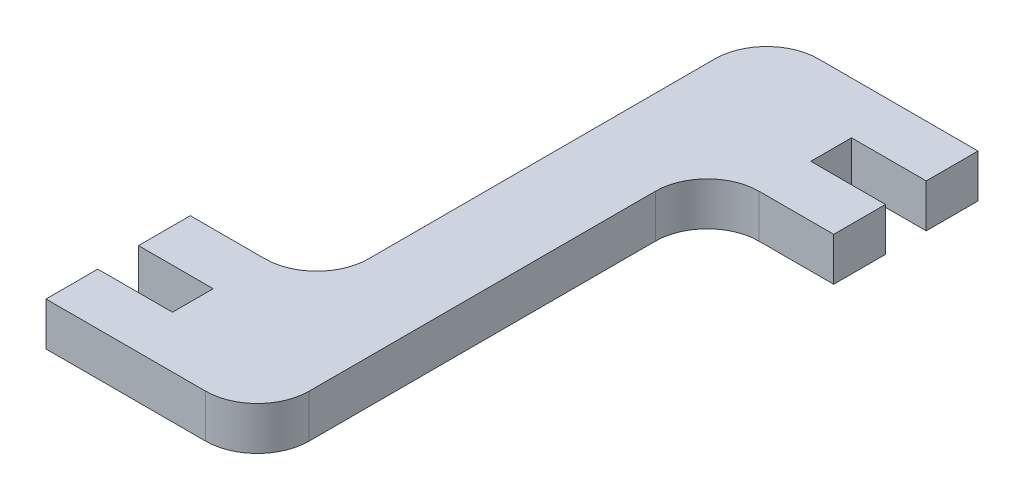
ISO-10303-21;
HEADER;
FILE_DESCRIPTION(('STEP AP214'),'2;1');
FILE_NAME('part.step','',(''),(''),'','','');
FILE_SCHEMA(('AUTOMOTIVE_DESIGN { 1 0 10303 214 1 1 1 1 }'));
ENDSEC;
DATA;
#1=APPLICATION_CONTEXT('core data for automotive mechanical design processes');
#2=APPLICATION_PROTOCOL_DEFINITION('international standard','automotive_design',2000,#1);
#3=PRODUCT_CONTEXT('',#1,'mechanical');
#4=PRODUCT('Part','Part','',(#3));
#5=PRODUCT_RELATED_PRODUCT_CATEGORY('part','',(#4));
#6=PRODUCT_DEFINITION_FORMATION('','',#4);
#7=PRODUCT_DEFINITION_CONTEXT('part definition',#1,'design');
#8=PRODUCT_DEFINITION('design','',#6,#7);
#9=PRODUCT_DEFINITION_SHAPE('','',#8);
#10=(LENGTH_UNIT() NAMED_UNIT(*) SI_UNIT(.MILLI.,.METRE.));
#11=(NAMED_UNIT(*) PLANE_ANGLE_UNIT() SI_UNIT($,.RADIAN.));
#12=(NAMED_UNIT(*) SI_UNIT($,.STERADIAN.) SOLID_ANGLE_UNIT());
#13=UNCERTAINTY_MEASURE_WITH_UNIT(LENGTH_MEASURE(1.E-05),#10,'distance_accuracy_value','');
#14=(GEOMETRIC_REPRESENTATION_CONTEXT(3) GLOBAL_UNCERTAINTY_ASSIGNED_CONTEXT((#13)) GLOBAL_UNIT_ASSIGNED_CONTEXT((#10,
#11,#12)) REPRESENTATION_CONTEXT('',''));
#15=CARTESIAN_POINT('',(0.,0.,0.));
#16=DIRECTION('',(0.,0.,1.));
#17=DIRECTION('',(1.,0.,0.));
#18=AXIS2_PLACEMENT_3D('',#15,#16,#17);
#19=CARTESIAN_POINT('',(0.,5.1,0.));
#20=DIRECTION('',(1.,0.,0.));
#21=DIRECTION('',(0.,0.,-1.));
#22=AXIS2_PLACEMENT_3D('',#19,#20,#21);
#23=PLANE('',#22);
#24=DIRECTION('',(0.,0.,1.));
#25=VECTOR('',#24,1.);
#26=CARTESIAN_POINT('',(0.,0.,0.));
#27=LINE('',#26,#25);
#28=CARTESIAN_POINT('',(0.,0.,-6.1));
#29=VERTEX_POINT('',#28);
#30=CARTESIAN_POINT('',(0.,0.,0.));
#31=VERTEX_POINT('',#30);
#32=EDGE_CURVE('E201',#29,#31,#27,.T.);
#33=ORIENTED_EDGE('',*,*,#32,.T.);
#34=DIRECTION('',(0.,-1.,0.));
#35=VECTOR('',#34,1.);
#36=CARTESIAN_POINT('',(0.,5.1,0.));
#37=LINE('',#36,#35);
#38=CARTESIAN_POINT('',(0.,5.1,0.));
#39=VERTEX_POINT('',#38);
#40=EDGE_CURVE('E11',#39,#31,#37,.T.);
#41=ORIENTED_EDGE('',*,*,#40,.F.);
#42=DIRECTION('',(0.,0.,1.));
#43=VECTOR('',#42,1.);
#44=CARTESIAN_POINT('',(0.,5.1,0.));
#45=LINE('',#44,#43);
#46=CARTESIAN_POINT('',(0.,5.1,-6.1));
#47=VERTEX_POINT('',#46);
#48=EDGE_CURVE('E239',#47,#39,#45,.T.);
#49=ORIENTED_EDGE('',*,*,#48,.F.);
#50=DIRECTION('',(0.,-1.,0.));
#51=VECTOR('',#50,1.);
#52=CARTESIAN_POINT('',(0.,5.1,-6.1));
#53=LINE('',#52,#51);
#54=EDGE_CURVE('E197',#47,#29,#53,.T.);
#55=ORIENTED_EDGE('',*,*,#54,.T.);
#56=EDGE_LOOP('',(#33,#41,#49,#55));
#57=FACE_BOUND('',#56,.T.);
#58=ADVANCED_FACE('F33',(#57),#23,.F.);
#59=CARTESIAN_POINT('',(0.,5.1,0.));
#60=DIRECTION('',(0.,0.,-1.));
#61=DIRECTION('',(-1.,0.,0.));
#62=AXIS2_PLACEMENT_3D('',#59,#60,#61);
#63=PLANE('',#62);
#64=DIRECTION('',(1.,0.,0.));
#65=VECTOR('',#64,1.);
#66=CARTESIAN_POINT('',(0.,0.,0.));
#67=LINE('',#66,#65);
#68=CARTESIAN_POINT('',(18.8,0.,0.));
#69=VERTEX_POINT('',#68);
#70=EDGE_CURVE('E204',#31,#69,#67,.T.);
#71=ORIENTED_EDGE('',*,*,#70,.T.);
#72=DIRECTION('',(0.,-1.,0.));
#73=VECTOR('',#72,1.);
#74=CARTESIAN_POINT('',(18.8,5.1,0.));
#75=LINE('',#74,#73);
#76=CARTESIAN_POINT('',(18.8,5.1,0.));
#77=VERTEX_POINT('',#76);
#78=EDGE_CURVE('E41',#77,#69,#75,.T.);
#79=ORIENTED_EDGE('',*,*,#78,.F.);
#80=DIRECTION('',(1.,0.,0.));
#81=VECTOR('',#80,1.);
#82=CARTESIAN_POINT('',(0.,5.1,0.));
#83=LINE('',#82,#81);
#84=EDGE_CURVE('E128',#39,#77,#83,.T.);
#85=ORIENTED_EDGE('',*,*,#84,.F.);
#86=ORIENTED_EDGE('',*,*,#40,.T.);
#87=EDGE_LOOP('',(#71,#79,#85,#86));
#88=FACE_BOUND('',#87,.T.);
#89=ADVANCED_FACE('F357',(#88),#63,.F.);
#90=CARTESIAN_POINT('',(18.8,5.1,-6.1));
#91=DIRECTION('',(0.,-1.,0.));
#92=DIRECTION('',(0.,0.,-1.));
#93=AXIS2_PLACEMENT_3D('',#90,#91,#92);
#94=CYLINDRICAL_SURFACE('',#93,6.1);
#95=CARTESIAN_POINT('',(18.8,0.,-6.1));
#96=DIRECTION('',(0.,1.,0.));
#97=DIRECTION('',(0.,0.,1.));
#98=AXIS2_PLACEMENT_3D('',#95,#96,#97);
#99=CIRCLE('',#98,6.1);
#100=CARTESIAN_POINT('',(24.9,0.,-6.1));
#101=VERTEX_POINT('',#100);
#102=EDGE_CURVE('E206',#69,#101,#99,.T.);
#103=ORIENTED_EDGE('',*,*,#102,.T.);
#104=DIRECTION('',(0.,-1.,0.));
#105=VECTOR('',#104,1.);
#106=CARTESIAN_POINT('',(24.9,5.1,-6.1));
#107=LINE('',#106,#105);
#108=CARTESIAN_POINT('',(24.9,5.1,-6.1));
#109=VERTEX_POINT('',#108);
#110=EDGE_CURVE('E282',#109,#101,#107,.T.);
#111=ORIENTED_EDGE('',*,*,#110,.F.);
#112=CARTESIAN_POINT('',(18.8,5.1,-6.1));
#113=DIRECTION('',(0.,1.,0.));
#114=DIRECTION('',(0.,0.,1.));
#115=AXIS2_PLACEMENT_3D('',#112,#113,#114);
#116=CIRCLE('',#115,6.1);
#117=EDGE_CURVE('E290',#77,#109,#116,.T.);
#118=ORIENTED_EDGE('',*,*,#117,.F.);
#119=ORIENTED_EDGE('',*,*,#78,.T.);
#120=EDGE_LOOP('',(#103,#111,#118,#119));
#121=FACE_BOUND('',#120,.T.);
#122=ADVANCED_FACE('F288',(#121),#94,.T.);
#123=CARTESIAN_POINT('',(24.9,5.1,-6.1));
#124=DIRECTION('',(-1.,0.,0.));
#125=DIRECTION('',(0.,0.,1.));
#126=AXIS2_PLACEMENT_3D('',#123,#124,#125);
#127=PLANE('',#126);
#128=DIRECTION('',(0.,0.,-1.));
#129=VECTOR('',#128,1.);
#130=CARTESIAN_POINT('',(24.9,0.,-6.1));
#131=LINE('',#130,#129);
#132=CARTESIAN_POINT('',(24.9,0.,-46.9));
#133=VERTEX_POINT('',#132);
#134=EDGE_CURVE('E208',#101,#133,#131,.T.);
#135=ORIENTED_EDGE('',*,*,#134,.T.);
#136=DIRECTION('',(0.,-1.,0.));
#137=VECTOR('',#136,1.);
#138=CARTESIAN_POINT('',(24.9,5.1,-46.9));
#139=LINE('',#138,#137);
#140=CARTESIAN_POINT('',(24.9,5.1,-46.9));
#141=VERTEX_POINT('',#140);
#142=EDGE_CURVE('E279',#141,#133,#139,.T.);
#143=ORIENTED_EDGE('',*,*,#142,.F.);
#144=DIRECTION('',(0.,0.,-1.));
#145=VECTOR('',#144,1.);
#146=CARTESIAN_POINT('',(24.9,5.1,-6.1));
#147=LINE('',#146,#145);
#148=EDGE_CURVE('E308',#109,#141,#147,.T.);
#149=ORIENTED_EDGE('',*,*,#148,.F.);
#150=ORIENTED_EDGE('',*,*,#110,.T.);
#151=EDGE_LOOP('',(#135,#143,#149,#150));
#152=FACE_BOUND('',#151,.T.);
#153=ADVANCED_FACE('F299',(#152),#127,.F.);
#154=CARTESIAN_POINT('',(31.,5.1,-46.9));
#155=DIRECTION('',(0.,-1.,0.));
#156=DIRECTION('',(0.,0.,-1.));
#157=AXIS2_PLACEMENT_3D('',#154,#155,#156);
#158=CYLINDRICAL_SURFACE('',#157,6.1);
#159=CARTESIAN_POINT('',(31.,0.,-46.9));
#160=DIRECTION('',(0.,-1.,0.));
#161=DIRECTION('',(0.,0.,-1.));
#162=AXIS2_PLACEMENT_3D('',#159,#160,#161);
#163=CIRCLE('',#162,6.1);
#164=CARTESIAN_POINT('',(31.,0.,-53.));
#165=VERTEX_POINT('',#164);
#166=EDGE_CURVE('E210',#133,#165,#163,.T.);
#167=ORIENTED_EDGE('',*,*,#166,.T.);
#168=DIRECTION('',(0.,-1.,0.));
#169=VECTOR('',#168,1.);
#170=CARTESIAN_POINT('',(31.,5.1,-53.));
#171=LINE('',#170,#169);
#172=CARTESIAN_POINT('',(31.,5.1,-53.));
#173=VERTEX_POINT('',#172);
#174=EDGE_CURVE('E276',#173,#165,#171,.T.);
#175=ORIENTED_EDGE('',*,*,#174,.F.);
#176=CARTESIAN_POINT('',(31.,5.1,-46.9));
#177=DIRECTION('',(0.,-1.,0.));
#178=DIRECTION('',(0.,0.,-1.));
#179=AXIS2_PLACEMENT_3D('',#176,#177,#178);
#180=CIRCLE('',#179,6.1);
#181=EDGE_CURVE('E305',#141,#173,#180,.T.);
#182=ORIENTED_EDGE('',*,*,#181,.F.);
#183=ORIENTED_EDGE('',*,*,#142,.T.);
#184=EDGE_LOOP('',(#167,#175,#182,#183));
#185=FACE_BOUND('',#184,.T.);
#186=ADVANCED_FACE('F303',(#185),#158,.F.);
#187=CARTESIAN_POINT('',(39.8,5.1,-53.));
#188=DIRECTION('',(0.,0.,-1.));
#189=DIRECTION('',(-1.,0.,0.));
#190=AXIS2_PLACEMENT_3D('',#187,#188,#189);
#191=PLANE('',#190);
#192=DIRECTION('',(1.,0.,0.));
#193=VECTOR('',#192,1.);
#194=CARTESIAN_POINT('',(39.8,0.,-53.));
#195=LINE('',#194,#193);
#196=CARTESIAN_POINT('',(39.8,0.,-53.));
#197=VERTEX_POINT('',#196);
#198=EDGE_CURVE('E212',#165,#197,#195,.T.);
#199=ORIENTED_EDGE('',*,*,#198,.T.);
#200=DIRECTION('',(0.,-1.,0.));
#201=VECTOR('',#200,1.);
#202=CARTESIAN_POINT('',(39.8,5.1,-53.));
#203=LINE('',#202,#201);
#204=CARTESIAN_POINT('',(39.8,5.1,-53.));
#205=VERTEX_POINT('',#204);
#206=EDGE_CURVE('E273',#205,#197,#203,.T.);
#207=ORIENTED_EDGE('',*,*,#206,.F.);
#208=DIRECTION('',(1.,0.,0.));
#209=VECTOR('',#208,1.);
#210=CARTESIAN_POINT('',(39.8,5.1,-53.));
#211=LINE('',#210,#209);
#212=EDGE_CURVE('E307',#173,#205,#211,.T.);
#213=ORIENTED_EDGE('',*,*,#212,.F.);
#214=ORIENTED_EDGE('',*,*,#174,.T.);
#215=EDGE_LOOP('',(#199,#207,#213,#214));
#216=FACE_BOUND('',#215,.T.);
#217=ADVANCED_FACE('F370',(#216),#191,.F.);
#218=CARTESIAN_POINT('',(39.8,5.1,-59.1));
#219=DIRECTION('',(-1.,0.,0.));
#220=DIRECTION('',(0.,0.,1.));
#221=AXIS2_PLACEMENT_3D('',#218,#219,#220);
#222=PLANE('',#221);
#223=DIRECTION('',(0.,0.,-1.));
#224=VECTOR('',#223,1.);
#225=CARTESIAN_POINT('',(39.8,0.,-59.1));
#226=LINE('',#225,#224);
#227=CARTESIAN_POINT('',(39.8,0.,-59.1));
#228=VERTEX_POINT('',#227);
#229=EDGE_CURVE('E214',#197,#228,#226,.T.);
#230=ORIENTED_EDGE('',*,*,#229,.T.);
#231=DIRECTION('',(0.,-1.,0.));
#232=VECTOR('',#231,1.);
#233=CARTESIAN_POINT('',(39.8,5.1,-59.1));
#234=LINE('',#233,#232);
#235=CARTESIAN_POINT('',(39.8,5.1,-59.1));
#236=VERTEX_POINT('',#235);
#237=EDGE_CURVE('E270',#236,#228,#234,.T.);
#238=ORIENTED_EDGE('',*,*,#237,.F.);
#239=DIRECTION('',(0.,0.,-1.));
#240=VECTOR('',#239,1.);
#241=CARTESIAN_POINT('',(39.8,5.1,-59.1));
#242=LINE('',#241,#240);
#243=EDGE_CURVE('E310',#205,#236,#242,.T.);
#244=ORIENTED_EDGE('',*,*,#243,.F.);
#245=ORIENTED_EDGE('',*,*,#206,.T.);
#246=EDGE_LOOP('',(#230,#238,#244,#245));
#247=FACE_BOUND('',#246,.T.);
#248=ADVANCED_FACE('F373',(#247),#222,.F.);
#249=CARTESIAN_POINT('',(31.,5.1,-59.1));
#250=DIRECTION('',(0.,0.,1.));
#251=DIRECTION('',(1.,0.,0.));
#252=AXIS2_PLACEMENT_3D('',#249,#250,#251);
#253=PLANE('',#252);
#254=DIRECTION('',(-1.,0.,0.));
#255=VECTOR('',#254,1.);
#256=CARTESIAN_POINT('',(31.,0.,-59.1));
#257=LINE('',#256,#255);
#258=CARTESIAN_POINT('',(31.,0.,-59.1));
#259=VERTEX_POINT('',#258);
#260=EDGE_CURVE('E216',#228,#259,#257,.T.);
#261=ORIENTED_EDGE('',*,*,#260,.T.);
#262=DIRECTION('',(0.,-1.,0.));
#263=VECTOR('',#262,1.);
#264=CARTESIAN_POINT('',(31.,5.1,-59.1));
#265=LINE('',#264,#263);
#266=CARTESIAN_POINT('',(31.,5.1,-59.1));
#267=VERTEX_POINT('',#266);
#268=EDGE_CURVE('E267',#267,#259,#265,.T.);
#269=ORIENTED_EDGE('',*,*,#268,.F.);
#270=DIRECTION('',(-1.,0.,0.));
#271=VECTOR('',#270,1.);
#272=CARTESIAN_POINT('',(31.,5.1,-59.1));
#273=LINE('',#272,#271);
#274=EDGE_CURVE('E316',#236,#267,#273,.T.);
#275=ORIENTED_EDGE('',*,*,#274,.F.);
#276=ORIENTED_EDGE('',*,*,#237,.T.);
#277=EDGE_LOOP('',(#261,#269,#275,#276));
#278=FACE_BOUND('',#277,.T.);
#279=ADVANCED_FACE('F377',(#278),#253,.F.);
#280=CARTESIAN_POINT('',(31.,5.1,-63.9));
#281=DIRECTION('',(-1.,0.,0.));
#282=DIRECTION('',(0.,0.,1.));
#283=AXIS2_PLACEMENT_3D('',#280,#281,#282);
#284=PLANE('',#283);
#285=DIRECTION('',(0.,0.,-1.));
#286=VECTOR('',#285,1.);
#287=CARTESIAN_POINT('',(31.,0.,-63.9));
#288=LINE('',#287,#286);
#289=CARTESIAN_POINT('',(31.,0.,-63.9));
#290=VERTEX_POINT('',#289);
#291=EDGE_CURVE('E218',#259,#290,#288,.T.);
#292=ORIENTED_EDGE('',*,*,#291,.T.);
#293=DIRECTION('',(0.,-1.,0.));
#294=VECTOR('',#293,1.);
#295=CARTESIAN_POINT('',(31.,5.1,-63.9));
#296=LINE('',#295,#294);
#297=CARTESIAN_POINT('',(31.,5.1,-63.9));
#298=VERTEX_POINT('',#297);
#299=EDGE_CURVE('E264',#298,#290,#296,.T.);
#300=ORIENTED_EDGE('',*,*,#299,.F.);
#301=DIRECTION('',(0.,0.,-1.));
#302=VECTOR('',#301,1.);
#303=CARTESIAN_POINT('',(31.,5.1,-63.9));
#304=LINE('',#303,#302);
#305=EDGE_CURVE('E318',#267,#298,#304,.T.);
#306=ORIENTED_EDGE('',*,*,#305,.F.);
#307=ORIENTED_EDGE('',*,*,#268,.T.);
#308=EDGE_LOOP('',(#292,#300,#306,#307));
#309=FACE_BOUND('',#308,.T.);
#310=ADVANCED_FACE('F381',(#309),#284,.F.);
#311=CARTESIAN_POINT('',(39.8,5.1,-63.9));
#312=DIRECTION('',(0.,0.,-1.));
#313=DIRECTION('',(-1.,0.,0.));
#314=AXIS2_PLACEMENT_3D('',#311,#312,#313);
#315=PLANE('',#314);
#316=DIRECTION('',(1.,0.,0.));
#317=VECTOR('',#316,1.);
#318=CARTESIAN_POINT('',(39.8,0.,-63.9));
#319=LINE('',#318,#317);
#320=CARTESIAN_POINT('',(39.8,0.,-63.9));
#321=VERTEX_POINT('',#320);
#322=EDGE_CURVE('E220',#290,#321,#319,.T.);
#323=ORIENTED_EDGE('',*,*,#322,.T.);
#324=DIRECTION('',(0.,-1.,0.));
#325=VECTOR('',#324,1.);
#326=CARTESIAN_POINT('',(39.8,5.1,-63.9));
#327=LINE('',#326,#325);
#328=CARTESIAN_POINT('',(39.8,5.1,-63.9));
#329=VERTEX_POINT('',#328);
#330=EDGE_CURVE('E261',#329,#321,#327,.T.);
#331=ORIENTED_EDGE('',*,*,#330,.F.);
#332=DIRECTION('',(1.,0.,0.));
#333=VECTOR('',#332,1.);
#334=CARTESIAN_POINT('',(39.8,5.1,-63.9));
#335=LINE('',#334,#333);
#336=EDGE_CURVE('E320',#298,#329,#335,.T.);
#337=ORIENTED_EDGE('',*,*,#336,.F.);
#338=ORIENTED_EDGE('',*,*,#299,.T.);
#339=EDGE_LOOP('',(#323,#331,#337,#338));
#340=FACE_BOUND('',#339,.T.);
#341=ADVANCED_FACE('F385',(#340),#315,.F.);
#342=CARTESIAN_POINT('',(39.8,5.1,-70.));
#343=DIRECTION('',(-1.,0.,0.));
#344=DIRECTION('',(0.,0.,1.));
#345=AXIS2_PLACEMENT_3D('',#342,#343,#344);
#346=PLANE('',#345);
#347=DIRECTION('',(0.,0.,-1.));
#348=VECTOR('',#347,1.);
#349=CARTESIAN_POINT('',(39.8,0.,-70.));
#350=LINE('',#349,#348);
#351=CARTESIAN_POINT('',(39.8,0.,-70.));
#352=VERTEX_POINT('',#351);
#353=EDGE_CURVE('E222',#321,#352,#350,.T.);
#354=ORIENTED_EDGE('',*,*,#353,.T.);
#355=DIRECTION('',(0.,-1.,0.));
#356=VECTOR('',#355,1.);
#357=CARTESIAN_POINT('',(39.8,5.1,-70.));
#358=LINE('',#357,#356);
#359=CARTESIAN_POINT('',(39.8,5.1,-70.));
#360=VERTEX_POINT('',#359);
#361=EDGE_CURVE('E258',#360,#352,#358,.T.);
#362=ORIENTED_EDGE('',*,*,#361,.F.);
#363=DIRECTION('',(0.,0.,-1.));
#364=VECTOR('',#363,1.);
#365=CARTESIAN_POINT('',(39.8,5.1,-70.));
#366=LINE('',#365,#364);
#367=EDGE_CURVE('E322',#329,#360,#366,.T.);
#368=ORIENTED_EDGE('',*,*,#367,.F.);
#369=ORIENTED_EDGE('',*,*,#330,.T.);
#370=EDGE_LOOP('',(#354,#362,#368,#369));
#371=FACE_BOUND('',#370,.T.);
#372=ADVANCED_FACE('F389',(#371),#346,.F.);
#373=CARTESIAN_POINT('',(21.,5.1,-70.));
#374=DIRECTION('',(0.,0.,1.));
#375=DIRECTION('',(1.,0.,0.));
#376=AXIS2_PLACEMENT_3D('',#373,#374,#375);
#377=PLANE('',#376);
#378=DIRECTION('',(-1.,0.,0.));
#379=VECTOR('',#378,1.);
#380=CARTESIAN_POINT('',(21.,0.,-70.));
#381=LINE('',#380,#379);
#382=CARTESIAN_POINT('',(21.,0.,-70.));
#383=VERTEX_POINT('',#382);
#384=EDGE_CURVE('E224',#352,#383,#381,.T.);
#385=ORIENTED_EDGE('',*,*,#384,.T.);
#386=DIRECTION('',(0.,-1.,0.));
#387=VECTOR('',#386,1.);
#388=CARTESIAN_POINT('',(21.,5.1,-70.));
#389=LINE('',#388,#387);
#390=CARTESIAN_POINT('',(21.,5.1,-70.));
#391=VERTEX_POINT('',#390);
#392=EDGE_CURVE('E255',#391,#383,#389,.T.);
#393=ORIENTED_EDGE('',*,*,#392,.F.);
#394=DIRECTION('',(-1.,0.,0.));
#395=VECTOR('',#394,1.);
#396=CARTESIAN_POINT('',(21.,5.1,-70.));
#397=LINE('',#396,#395);
#398=EDGE_CURVE('E324',#360,#391,#397,.T.);
#399=ORIENTED_EDGE('',*,*,#398,.F.);
#400=ORIENTED_EDGE('',*,*,#361,.T.);
#401=EDGE_LOOP('',(#385,#393,#399,#400));
#402=FACE_BOUND('',#401,.T.);
#403=ADVANCED_FACE('F393',(#402),#377,.F.);
#404=CARTESIAN_POINT('',(21.,5.1,-63.9));
#405=DIRECTION('',(0.,-1.,0.));
#406=DIRECTION('',(0.,0.,-1.));
#407=AXIS2_PLACEMENT_3D('',#404,#405,#406);
#408=CYLINDRICAL_SURFACE('',#407,6.1);
#409=CARTESIAN_POINT('',(21.,0.,-63.9));
#410=DIRECTION('',(0.,1.,0.));
#411=DIRECTION('',(0.,0.,-1.));
#412=AXIS2_PLACEMENT_3D('',#409,#410,#411);
#413=CIRCLE('',#412,6.1);
#414=CARTESIAN_POINT('',(14.9,0.,-63.9));
#415=VERTEX_POINT('',#414);
#416=EDGE_CURVE('E226',#383,#415,#413,.T.);
#417=ORIENTED_EDGE('',*,*,#416,.T.);
#418=DIRECTION('',(0.,-1.,0.));
#419=VECTOR('',#418,1.);
#420=CARTESIAN_POINT('',(14.9,5.1,-63.9));
#421=LINE('',#420,#419);
#422=CARTESIAN_POINT('',(14.9,5.1,-63.9));
#423=VERTEX_POINT('',#422);
#424=EDGE_CURVE('E252',#423,#415,#421,.T.);
#425=ORIENTED_EDGE('',*,*,#424,.F.);
#426=CARTESIAN_POINT('',(21.,5.1,-63.9));
#427=DIRECTION('',(0.,1.,0.));
#428=DIRECTION('',(0.,0.,-1.));
#429=AXIS2_PLACEMENT_3D('',#426,#427,#428);
#430=CIRCLE('',#429,6.1);
#431=EDGE_CURVE('E326',#391,#423,#430,.T.);
#432=ORIENTED_EDGE('',*,*,#431,.F.);
#433=ORIENTED_EDGE('',*,*,#392,.T.);
#434=EDGE_LOOP('',(#417,#425,#432,#433));
#435=FACE_BOUND('',#434,.T.);
#436=ADVANCED_FACE('F397',(#435),#408,.T.);
#437=CARTESIAN_POINT('',(14.9,5.1,-23.1));
#438=DIRECTION('',(1.,0.,0.));
#439=DIRECTION('',(0.,0.,-1.));
#440=AXIS2_PLACEMENT_3D('',#437,#438,#439);
#441=PLANE('',#440);
#442=DIRECTION('',(0.,0.,1.));
#443=VECTOR('',#442,1.);
#444=CARTESIAN_POINT('',(14.9,0.,-23.1));
#445=LINE('',#444,#443);
#446=CARTESIAN_POINT('',(14.9,0.,-23.1));
#447=VERTEX_POINT('',#446);
#448=EDGE_CURVE('E228',#415,#447,#445,.T.);
#449=ORIENTED_EDGE('',*,*,#448,.T.);
#450=DIRECTION('',(0.,-1.,0.));
#451=VECTOR('',#450,1.);
#452=CARTESIAN_POINT('',(14.9,5.1,-23.1));
#453=LINE('',#452,#451);
#454=CARTESIAN_POINT('',(14.9,5.1,-23.1));
#455=VERTEX_POINT('',#454);
#456=EDGE_CURVE('E249',#455,#447,#453,.T.);
#457=ORIENTED_EDGE('',*,*,#456,.F.);
#458=DIRECTION('',(0.,0.,1.));
#459=VECTOR('',#458,1.);
#460=CARTESIAN_POINT('',(14.9,5.1,-23.1));
#461=LINE('',#460,#459);
#462=EDGE_CURVE('E328',#423,#455,#461,.T.);
#463=ORIENTED_EDGE('',*,*,#462,.F.);
#464=ORIENTED_EDGE('',*,*,#424,.T.);
#465=EDGE_LOOP('',(#449,#457,#463,#464));
#466=FACE_BOUND('',#465,.T.);
#467=ADVANCED_FACE('F401',(#466),#441,.F.);
#468=CARTESIAN_POINT('',(8.8,5.1,-23.1));
#469=DIRECTION('',(0.,-1.,0.));
#470=DIRECTION('',(0.,0.,-1.));
#471=AXIS2_PLACEMENT_3D('',#468,#469,#470);
#472=CYLINDRICAL_SURFACE('',#471,6.1);
#473=CARTESIAN_POINT('',(8.8,0.,-23.1));
#474=DIRECTION('',(0.,-1.,0.));
#475=DIRECTION('',(0.,0.,1.));
#476=AXIS2_PLACEMENT_3D('',#473,#474,#475);
#477=CIRCLE('',#476,6.1);
#478=CARTESIAN_POINT('',(8.8,0.,-17.));
#479=VERTEX_POINT('',#478);
#480=EDGE_CURVE('E230',#447,#479,#477,.T.);
#481=ORIENTED_EDGE('',*,*,#480,.T.);
#482=DIRECTION('',(0.,-1.,0.));
#483=VECTOR('',#482,1.);
#484=CARTESIAN_POINT('',(8.8,5.1,-17.));
#485=LINE('',#484,#483);
#486=CARTESIAN_POINT('',(8.8,5.1,-17.));
#487=VERTEX_POINT('',#486);
#488=EDGE_CURVE('E246',#487,#479,#485,.T.);
#489=ORIENTED_EDGE('',*,*,#488,.F.);
#490=CARTESIAN_POINT('',(8.8,5.1,-23.1));
#491=DIRECTION('',(0.,-1.,0.));
#492=DIRECTION('',(0.,0.,1.));
#493=AXIS2_PLACEMENT_3D('',#490,#491,#492);
#494=CIRCLE('',#493,6.1);
#495=EDGE_CURVE('E330',#455,#487,#494,.T.);
#496=ORIENTED_EDGE('',*,*,#495,.F.);
#497=ORIENTED_EDGE('',*,*,#456,.T.);
#498=EDGE_LOOP('',(#481,#489,#496,#497));
#499=FACE_BOUND('',#498,.T.);
#500=ADVANCED_FACE('F405',(#499),#472,.F.);
#501=CARTESIAN_POINT('',(0.,5.1,-17.));
#502=DIRECTION('',(0.,0.,1.));
#503=DIRECTION('',(1.,0.,0.));
#504=AXIS2_PLACEMENT_3D('',#501,#502,#503);
#505=PLANE('',#504);
#506=DIRECTION('',(-1.,0.,0.));
#507=VECTOR('',#506,1.);
#508=CARTESIAN_POINT('',(0.,0.,-17.));
#509=LINE('',#508,#507);
#510=CARTESIAN_POINT('',(0.,0.,-17.));
#511=VERTEX_POINT('',#510);
#512=EDGE_CURVE('E232',#479,#511,#509,.T.);
#513=ORIENTED_EDGE('',*,*,#512,.T.);
#514=DIRECTION('',(0.,-1.,0.));
#515=VECTOR('',#514,1.);
#516=CARTESIAN_POINT('',(0.,5.1,-17.));
#517=LINE('',#516,#515);
#518=CARTESIAN_POINT('',(0.,5.1,-17.));
#519=VERTEX_POINT('',#518);
#520=EDGE_CURVE('E243',#519,#511,#517,.T.);
#521=ORIENTED_EDGE('',*,*,#520,.F.);
#522=DIRECTION('',(-1.,0.,0.));
#523=VECTOR('',#522,1.);
#524=CARTESIAN_POINT('',(0.,5.1,-17.));
#525=LINE('',#524,#523);
#526=EDGE_CURVE('E332',#487,#519,#525,.T.);
#527=ORIENTED_EDGE('',*,*,#526,.F.);
#528=ORIENTED_EDGE('',*,*,#488,.T.);
#529=EDGE_LOOP('',(#513,#521,#527,#528));
#530=FACE_BOUND('',#529,.T.);
#531=ADVANCED_FACE('F338',(#530),#505,.F.);
#532=CARTESIAN_POINT('',(0.,5.1,-10.9));
#533=DIRECTION('',(1.,0.,0.));
#534=DIRECTION('',(0.,0.,-1.));
#535=AXIS2_PLACEMENT_3D('',#532,#533,#534);
#536=PLANE('',#535);
#537=DIRECTION('',(0.,0.,1.));
#538=VECTOR('',#537,1.);
#539=CARTESIAN_POINT('',(0.,0.,-10.9));
#540=LINE('',#539,#538);
#541=CARTESIAN_POINT('',(0.,0.,-10.9));
#542=VERTEX_POINT('',#541);
#543=EDGE_CURVE('E234',#511,#542,#540,.T.);
#544=ORIENTED_EDGE('',*,*,#543,.T.);
#545=DIRECTION('',(0.,-1.,0.));
#546=VECTOR('',#545,1.);
#547=CARTESIAN_POINT('',(0.,5.1,-10.9));
#548=LINE('',#547,#546);
#549=CARTESIAN_POINT('',(0.,5.1,-10.9));
#550=VERTEX_POINT('',#549);
#551=EDGE_CURVE('E192',#550,#542,#548,.T.);
#552=ORIENTED_EDGE('',*,*,#551,.F.);
#553=DIRECTION('',(0.,0.,1.));
#554=VECTOR('',#553,1.);
#555=CARTESIAN_POINT('',(0.,5.1,-10.9));
#556=LINE('',#555,#554);
#557=EDGE_CURVE('E183',#519,#550,#556,.T.);
#558=ORIENTED_EDGE('',*,*,#557,.F.);
#559=ORIENTED_EDGE('',*,*,#520,.T.);
#560=EDGE_LOOP('',(#544,#552,#558,#559));
#561=FACE_BOUND('',#560,.T.);
#562=ADVANCED_FACE('F342',(#561),#536,.F.);
#563=CARTESIAN_POINT('',(8.8,5.1,-10.9));
#564=DIRECTION('',(0.,0.,-1.));
#565=DIRECTION('',(-1.,0.,0.));
#566=AXIS2_PLACEMENT_3D('',#563,#564,#565);
#567=PLANE('',#566);
#568=DIRECTION('',(1.,0.,0.));
#569=VECTOR('',#568,1.);
#570=CARTESIAN_POINT('',(8.8,0.,-10.9));
#571=LINE('',#570,#569);
#572=CARTESIAN_POINT('',(8.8,0.,-10.9));
#573=VERTEX_POINT('',#572);
#574=EDGE_CURVE('E191',#542,#573,#571,.T.);
#575=ORIENTED_EDGE('',*,*,#574,.T.);
#576=DIRECTION('',(0.,-1.,0.));
#577=VECTOR('',#576,1.);
#578=CARTESIAN_POINT('',(8.8,5.1,-10.9));
#579=LINE('',#578,#577);
#580=CARTESIAN_POINT('',(8.8,5.1,-10.9));
#581=VERTEX_POINT('',#580);
#582=EDGE_CURVE('E188',#581,#573,#579,.T.);
#583=ORIENTED_EDGE('',*,*,#582,.F.);
#584=DIRECTION('',(1.,0.,0.));
#585=VECTOR('',#584,1.);
#586=CARTESIAN_POINT('',(8.8,5.1,-10.9));
#587=LINE('',#586,#585);
#588=EDGE_CURVE('E177',#550,#581,#587,.T.);
#589=ORIENTED_EDGE('',*,*,#588,.F.);
#590=ORIENTED_EDGE('',*,*,#551,.T.);
#591=EDGE_LOOP('',(#575,#583,#589,#590));
#592=FACE_BOUND('',#591,.T.);
#593=ADVANCED_FACE('F189',(#592),#567,.F.);
#594=CARTESIAN_POINT('',(8.8,5.1,-6.1));
#595=DIRECTION('',(1.,0.,0.));
#596=DIRECTION('',(0.,0.,-1.));
#597=AXIS2_PLACEMENT_3D('',#594,#595,#596);
#598=PLANE('',#597);
#599=DIRECTION('',(0.,0.,1.));
#600=VECTOR('',#599,1.);
#601=CARTESIAN_POINT('',(8.8,0.,-6.1));
#602=LINE('',#601,#600);
#603=CARTESIAN_POINT('',(8.8,0.,-6.1));
#604=VERTEX_POINT('',#603);
#605=EDGE_CURVE('E114',#573,#604,#602,.T.);
#606=ORIENTED_EDGE('',*,*,#605,.T.);
#607=DIRECTION('',(0.,-1.,0.));
#608=VECTOR('',#607,1.);
#609=CARTESIAN_POINT('',(8.8,5.1,-6.1));
#610=LINE('',#609,#608);
#611=CARTESIAN_POINT('',(8.8,5.1,-6.1));
#612=VERTEX_POINT('',#611);
#613=EDGE_CURVE('E193',#612,#604,#610,.T.);
#614=ORIENTED_EDGE('',*,*,#613,.F.);
#615=DIRECTION('',(0.,0.,1.));
#616=VECTOR('',#615,1.);
#617=CARTESIAN_POINT('',(8.8,5.1,-6.1));
#618=LINE('',#617,#616);
#619=EDGE_CURVE('E181',#581,#612,#618,.T.);
#620=ORIENTED_EDGE('',*,*,#619,.F.);
#621=ORIENTED_EDGE('',*,*,#582,.T.);
#622=EDGE_LOOP('',(#606,#614,#620,#621));
#623=FACE_BOUND('',#622,.T.);
#624=ADVANCED_FACE('F195',(#623),#598,.F.);
#625=CARTESIAN_POINT('',(0.,5.1,-6.1));
#626=DIRECTION('',(0.,0.,1.));
#627=DIRECTION('',(1.,0.,0.));
#628=AXIS2_PLACEMENT_3D('',#625,#626,#627);
#629=PLANE('',#628);
#630=DIRECTION('',(-1.,0.,0.));
#631=VECTOR('',#630,1.);
#632=CARTESIAN_POINT('',(0.,0.,-6.1));
#633=LINE('',#632,#631);
#634=EDGE_CURVE('E120',#604,#29,#633,.T.);
#635=ORIENTED_EDGE('',*,*,#634,.T.);
#636=ORIENTED_EDGE('',*,*,#54,.F.);
#637=DIRECTION('',(-1.,0.,0.));
#638=VECTOR('',#637,1.);
#639=CARTESIAN_POINT('',(0.,5.1,-6.1));
#640=LINE('',#639,#638);
#641=EDGE_CURVE('E49',#612,#47,#640,.T.);
#642=ORIENTED_EDGE('',*,*,#641,.F.);
#643=ORIENTED_EDGE('',*,*,#613,.T.);
#644=EDGE_LOOP('',(#635,#636,#642,#643));
#645=FACE_BOUND('',#644,.T.);
#646=ADVANCED_FACE('F346',(#645),#629,.F.);
#647=CARTESIAN_POINT('',(8.8,5.1,-23.1));
#648=DIRECTION('',(0.,1.,0.));
#649=DIRECTION('',(0.,0.,1.));
#650=AXIS2_PLACEMENT_3D('',#647,#648,#649);
#651=PLANE('',#650);
#652=ORIENTED_EDGE('',*,*,#48,.T.);
#653=ORIENTED_EDGE('',*,*,#84,.T.);
#654=ORIENTED_EDGE('',*,*,#117,.T.);
#655=ORIENTED_EDGE('',*,*,#148,.T.);
#656=ORIENTED_EDGE('',*,*,#181,.T.);
#657=ORIENTED_EDGE('',*,*,#212,.T.);
#658=ORIENTED_EDGE('',*,*,#243,.T.);
#659=ORIENTED_EDGE('',*,*,#274,.T.);
#660=ORIENTED_EDGE('',*,*,#305,.T.);
#661=ORIENTED_EDGE('',*,*,#336,.T.);
#662=ORIENTED_EDGE('',*,*,#367,.T.);
#663=ORIENTED_EDGE('',*,*,#398,.T.);
#664=ORIENTED_EDGE('',*,*,#431,.T.);
#665=ORIENTED_EDGE('',*,*,#462,.T.);
#666=ORIENTED_EDGE('',*,*,#495,.T.);
#667=ORIENTED_EDGE('',*,*,#526,.T.);
#668=ORIENTED_EDGE('',*,*,#557,.T.);
#669=ORIENTED_EDGE('',*,*,#588,.T.);
#670=ORIENTED_EDGE('',*,*,#619,.T.);
#671=ORIENTED_EDGE('',*,*,#641,.T.);
#672=EDGE_LOOP('',(#652,#653,#654,#655,#656,#657,#658,#659,#660,#661,#662,#663,#664,#665,#666,
#667,#668,#669,#670,#671));
#673=FACE_BOUND('',#672,.T.);
#674=ADVANCED_FACE('F179',(#673),#651,.T.);
#675=CARTESIAN_POINT('',(8.8,0.,-23.1));
#676=DIRECTION('',(0.,1.,0.));
#677=DIRECTION('',(0.,0.,1.));
#678=AXIS2_PLACEMENT_3D('',#675,#676,#677);
#679=PLANE('',#678);
#680=ORIENTED_EDGE('',*,*,#32,.F.);
#681=ORIENTED_EDGE('',*,*,#634,.F.);
#682=ORIENTED_EDGE('',*,*,#605,.F.);
#683=ORIENTED_EDGE('',*,*,#574,.F.);
#684=ORIENTED_EDGE('',*,*,#543,.F.);
#685=ORIENTED_EDGE('',*,*,#512,.F.);
#686=ORIENTED_EDGE('',*,*,#480,.F.);
#687=ORIENTED_EDGE('',*,*,#448,.F.);
#688=ORIENTED_EDGE('',*,*,#416,.F.);
#689=ORIENTED_EDGE('',*,*,#384,.F.);
#690=ORIENTED_EDGE('',*,*,#353,.F.);
#691=ORIENTED_EDGE('',*,*,#322,.F.);
#692=ORIENTED_EDGE('',*,*,#291,.F.);
#693=ORIENTED_EDGE('',*,*,#260,.F.);
#694=ORIENTED_EDGE('',*,*,#229,.F.);
#695=ORIENTED_EDGE('',*,*,#198,.F.);
#696=ORIENTED_EDGE('',*,*,#166,.F.);
#697=ORIENTED_EDGE('',*,*,#134,.F.);
#698=ORIENTED_EDGE('',*,*,#102,.F.);
#699=ORIENTED_EDGE('',*,*,#70,.F.);
#700=EDGE_LOOP('',(#680,#681,#682,#683,#684,#685,#686,#687,#688,#689,#690,#691,#692,#693,#694,
#695,#696,#697,#698,#699));
#701=FACE_BOUND('',#700,.T.);
#702=ADVANCED_FACE('F294',(#701),#679,.F.);
#703=CLOSED_SHELL('',(#58,#89,#122,#153,#186,#217,#248,#279,#310,#341,#372,#403,#436,#467,#500,
#531,#562,#593,#624,#646,#674,#702));
#704=MANIFOLD_SOLID_BREP('B2',#703);
#705=ADVANCED_BREP_SHAPE_REPRESENTATION('',(#18,#704),#14);
#706=SHAPE_DEFINITION_REPRESENTATION(#9,#705);
ENDSEC;
END-ISO-10303-21;
